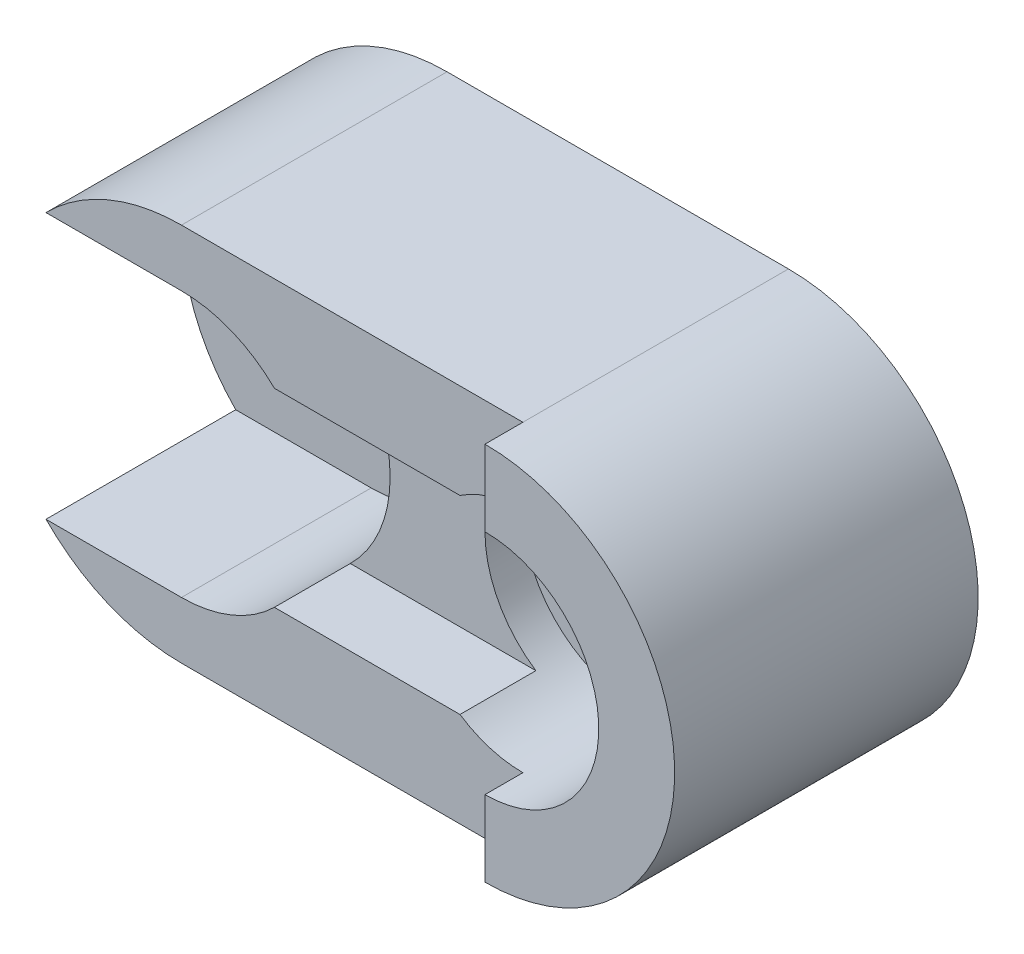
ISO-10303-21;
HEADER;
FILE_DESCRIPTION(('STEP AP214'),'2;1');
FILE_NAME('part.step','',(''),(''),'','','');
FILE_SCHEMA(('AUTOMOTIVE_DESIGN { 1 0 10303 214 1 1 1 1 }'));
ENDSEC;
DATA;
#1=APPLICATION_CONTEXT('core data for automotive mechanical design processes');
#2=APPLICATION_PROTOCOL_DEFINITION('international standard','automotive_design',2000,#1);
#3=PRODUCT_CONTEXT('',#1,'mechanical');
#4=PRODUCT('Part','Part','',(#3));
#5=PRODUCT_RELATED_PRODUCT_CATEGORY('part','',(#4));
#6=PRODUCT_DEFINITION_FORMATION('','',#4);
#7=PRODUCT_DEFINITION_CONTEXT('part definition',#1,'design');
#8=PRODUCT_DEFINITION('design','',#6,#7);
#9=PRODUCT_DEFINITION_SHAPE('','',#8);
#10=(LENGTH_UNIT() NAMED_UNIT(*) SI_UNIT(.MILLI.,.METRE.));
#11=(NAMED_UNIT(*) PLANE_ANGLE_UNIT() SI_UNIT($,.RADIAN.));
#12=(NAMED_UNIT(*) SI_UNIT($,.STERADIAN.) SOLID_ANGLE_UNIT());
#13=UNCERTAINTY_MEASURE_WITH_UNIT(LENGTH_MEASURE(1.E-05),#10,'distance_accuracy_value','');
#14=(GEOMETRIC_REPRESENTATION_CONTEXT(3) GLOBAL_UNCERTAINTY_ASSIGNED_CONTEXT((#13)) GLOBAL_UNIT_ASSIGNED_CONTEXT((#10,
#11,#12)) REPRESENTATION_CONTEXT('',''));
#15=CARTESIAN_POINT('',(0.,0.,0.));
#16=DIRECTION('',(0.,0.,1.));
#17=DIRECTION('',(1.,0.,0.));
#18=AXIS2_PLACEMENT_3D('',#15,#16,#17);
#19=CARTESIAN_POINT('',(0.,0.,70.));
#20=DIRECTION('',(0.,0.,1.));
#21=DIRECTION('',(1.,0.,0.));
#22=AXIS2_PLACEMENT_3D('',#19,#20,#21);
#23=PLANE('',#22);
#24=CARTESIAN_POINT('',(90.,0.,70.));
#25=DIRECTION('',(0.,0.,1.));
#26=DIRECTION('',(1.,0.,0.));
#27=AXIS2_PLACEMENT_3D('',#24,#25,#26);
#28=CIRCLE('',#27,30.);
#29=CARTESIAN_POINT('',(73.416876048223,-25.,70.));
#30=VERTEX_POINT('',#29);
#31=CARTESIAN_POINT('',(90.,-30.,70.));
#32=VERTEX_POINT('',#31);
#33=EDGE_CURVE('E215',#30,#32,#28,.T.);
#34=ORIENTED_EDGE('',*,*,#33,.F.);
#35=DIRECTION('',(-1.,0.,0.));
#36=VECTOR('',#35,1.);
#37=CARTESIAN_POINT('',(0.,-25.,70.));
#38=LINE('',#37,#36);
#39=CARTESIAN_POINT('',(24.4948974278318,-25.,70.));
#40=VERTEX_POINT('',#39);
#41=EDGE_CURVE('E146',#30,#40,#38,.T.);
#42=ORIENTED_EDGE('',*,*,#41,.T.);
#43=CARTESIAN_POINT('',(0.,0.,70.));
#44=DIRECTION('',(0.,0.,1.));
#45=DIRECTION('',(-1.,0.,0.));
#46=AXIS2_PLACEMENT_3D('',#43,#44,#45);
#47=CIRCLE('',#46,35.);
#48=CARTESIAN_POINT('',(0.,-35.,70.));
#49=VERTEX_POINT('',#48);
#50=EDGE_CURVE('E196',#49,#40,#47,.T.);
#51=ORIENTED_EDGE('',*,*,#50,.F.);
#52=DIRECTION('',(1.,0.,0.));
#53=VECTOR('',#52,1.);
#54=CARTESIAN_POINT('',(0.,-35.,70.));
#55=LINE('',#54,#53);
#56=CARTESIAN_POINT('',(-35.7071421427143,-35.,70.));
#57=VERTEX_POINT('',#56);
#58=EDGE_CURVE('E180',#57,#49,#55,.T.);
#59=ORIENTED_EDGE('',*,*,#58,.F.);
#60=CARTESIAN_POINT('',(0.,0.,70.));
#61=DIRECTION('',(0.,0.,1.));
#62=DIRECTION('',(1.,0.,0.));
#63=AXIS2_PLACEMENT_3D('',#60,#61,#62);
#64=CIRCLE('',#63,50.);
#65=CARTESIAN_POINT('',(0.,-50.,70.));
#66=VERTEX_POINT('',#65);
#67=EDGE_CURVE('E253',#57,#66,#64,.T.);
#68=ORIENTED_EDGE('',*,*,#67,.T.);
#69=DIRECTION('',(1.,0.,0.));
#70=VECTOR('',#69,1.);
#71=CARTESIAN_POINT('',(0.,-50.,70.));
#72=LINE('',#71,#70);
#73=CARTESIAN_POINT('',(90.,-50.,70.));
#74=VERTEX_POINT('',#73);
#75=EDGE_CURVE('E252',#66,#74,#72,.T.);
#76=ORIENTED_EDGE('',*,*,#75,.T.);
#77=DIRECTION('',(0.,-1.,0.));
#78=VECTOR('',#77,1.);
#79=CARTESIAN_POINT('',(90.,-30.,70.));
#80=LINE('',#79,#78);
#81=EDGE_CURVE('E226',#32,#74,#80,.T.);
#82=ORIENTED_EDGE('',*,*,#81,.F.);
#83=EDGE_LOOP('',(#34,#42,#51,#59,#68,#76,#82));
#84=FACE_BOUND('',#83,.T.);
#85=ADVANCED_FACE('F33',(#84),#23,.T.);
#86=CARTESIAN_POINT('',(90.,0.,80.));
#87=DIRECTION('',(0.,0.,-1.));
#88=DIRECTION('',(-1.,0.,0.));
#89=AXIS2_PLACEMENT_3D('',#86,#87,#88);
#90=CYLINDRICAL_SURFACE('',#89,30.);
#91=CARTESIAN_POINT('',(90.,0.,40.));
#92=DIRECTION('',(0.,0.,1.));
#93=DIRECTION('',(1.,0.,0.));
#94=AXIS2_PLACEMENT_3D('',#91,#92,#93);
#95=CIRCLE('',#94,30.);
#96=CARTESIAN_POINT('',(120.,0.,40.));
#97=VERTEX_POINT('',#96);
#98=EDGE_CURVE('E216',#97,#97,#95,.T.);
#99=ORIENTED_EDGE('',*,*,#98,.F.);
#100=EDGE_LOOP('',(#99));
#101=FACE_BOUND('',#100,.T.);
#102=DIRECTION('',(0.,0.,1.));
#103=VECTOR('',#102,1.);
#104=CARTESIAN_POINT('',(73.416876048223,-25.,50.));
#105=LINE('',#104,#103);
#106=CARTESIAN_POINT('',(73.416876048223,-25.,50.));
#107=VERTEX_POINT('',#106);
#108=EDGE_CURVE('E141',#107,#30,#105,.T.);
#109=ORIENTED_EDGE('',*,*,#108,.T.);
#110=ORIENTED_EDGE('',*,*,#33,.T.);
#111=DIRECTION('',(0.,0.,-1.));
#112=VECTOR('',#111,1.);
#113=CARTESIAN_POINT('',(90.,-30.,80.));
#114=LINE('',#113,#112);
#115=CARTESIAN_POINT('',(90.,-30.,80.));
#116=VERTEX_POINT('',#115);
#117=EDGE_CURVE('E239',#116,#32,#114,.T.);
#118=ORIENTED_EDGE('',*,*,#117,.F.);
#119=CARTESIAN_POINT('',(90.,0.,80.));
#120=DIRECTION('',(0.,0.,-1.));
#121=DIRECTION('',(-1.,0.,0.));
#122=AXIS2_PLACEMENT_3D('',#119,#120,#121);
#123=CIRCLE('',#122,30.);
#124=CARTESIAN_POINT('',(90.,30.,80.));
#125=VERTEX_POINT('',#124);
#126=EDGE_CURVE('E228',#125,#116,#123,.T.);
#127=ORIENTED_EDGE('',*,*,#126,.F.);
#128=DIRECTION('',(0.,0.,-1.));
#129=VECTOR('',#128,1.);
#130=CARTESIAN_POINT('',(90.,30.,80.));
#131=LINE('',#130,#129);
#132=CARTESIAN_POINT('',(90.,30.,70.));
#133=VERTEX_POINT('',#132);
#134=EDGE_CURVE('E242',#125,#133,#131,.T.);
#135=ORIENTED_EDGE('',*,*,#134,.T.);
#136=CARTESIAN_POINT('',(73.416876048223,25.,70.));
#137=VERTEX_POINT('',#136);
#138=EDGE_CURVE('E220',#133,#137,#28,.T.);
#139=ORIENTED_EDGE('',*,*,#138,.T.);
#140=DIRECTION('',(0.,0.,1.));
#141=VECTOR('',#140,1.);
#142=CARTESIAN_POINT('',(73.416876048223,25.,50.));
#143=LINE('',#142,#141);
#144=CARTESIAN_POINT('',(73.416876048223,25.,50.));
#145=VERTEX_POINT('',#144);
#146=EDGE_CURVE('E150',#145,#137,#143,.T.);
#147=ORIENTED_EDGE('',*,*,#146,.F.);
#148=CARTESIAN_POINT('',(90.,0.,50.));
#149=DIRECTION('',(0.,0.,1.));
#150=DIRECTION('',(1.,0.,0.));
#151=AXIS2_PLACEMENT_3D('',#148,#149,#150);
#152=CIRCLE('',#151,30.);
#153=EDGE_CURVE('E154',#107,#145,#152,.F.);
#154=ORIENTED_EDGE('',*,*,#153,.F.);
#155=EDGE_LOOP('',(#109,#110,#118,#127,#135,#139,#147,#154));
#156=FACE_BOUND('',#155,.T.);
#157=ADVANCED_FACE('F160',(#101,#156),#90,.F.);
#158=CARTESIAN_POINT('',(0.,0.,20.));
#159=DIRECTION('',(0.,0.,1.));
#160=DIRECTION('',(1.,0.,0.));
#161=AXIS2_PLACEMENT_3D('',#158,#159,#160);
#162=CYLINDRICAL_SURFACE('',#161,35.);
#163=DIRECTION('',(0.,0.,1.));
#164=VECTOR('',#163,1.);
#165=CARTESIAN_POINT('',(24.4948974278318,-25.,50.));
#166=LINE('',#165,#164);
#167=CARTESIAN_POINT('',(24.4948974278318,-25.,50.));
#168=VERTEX_POINT('',#167);
#169=EDGE_CURVE('E168',#168,#40,#166,.T.);
#170=ORIENTED_EDGE('',*,*,#169,.F.);
#171=CARTESIAN_POINT('',(0.,0.,50.));
#172=DIRECTION('',(0.,0.,1.));
#173=DIRECTION('',(1.,0.,0.));
#174=AXIS2_PLACEMENT_3D('',#171,#172,#173);
#175=CIRCLE('',#174,35.);
#176=CARTESIAN_POINT('',(24.4948974278318,25.,50.));
#177=VERTEX_POINT('',#176);
#178=EDGE_CURVE('E151',#177,#168,#175,.F.);
#179=ORIENTED_EDGE('',*,*,#178,.F.);
#180=DIRECTION('',(0.,0.,1.));
#181=VECTOR('',#180,1.);
#182=CARTESIAN_POINT('',(24.4948974278318,25.,50.));
#183=LINE('',#182,#181);
#184=CARTESIAN_POINT('',(24.4948974278318,25.,70.));
#185=VERTEX_POINT('',#184);
#186=EDGE_CURVE('E171',#177,#185,#183,.T.);
#187=ORIENTED_EDGE('',*,*,#186,.T.);
#188=CARTESIAN_POINT('',(0.,35.,70.));
#189=VERTEX_POINT('',#188);
#190=EDGE_CURVE('E195',#185,#189,#47,.T.);
#191=ORIENTED_EDGE('',*,*,#190,.T.);
#192=DIRECTION('',(0.,0.,1.));
#193=VECTOR('',#192,1.);
#194=CARTESIAN_POINT('',(0.,35.,20.));
#195=LINE('',#194,#193);
#196=CARTESIAN_POINT('',(0.,35.,20.));
#197=VERTEX_POINT('',#196);
#198=EDGE_CURVE('E204',#197,#189,#195,.T.);
#199=ORIENTED_EDGE('',*,*,#198,.F.);
#200=CARTESIAN_POINT('',(0.,0.,20.));
#201=DIRECTION('',(0.,0.,1.));
#202=DIRECTION('',(-1.,0.,0.));
#203=AXIS2_PLACEMENT_3D('',#200,#201,#202);
#204=CIRCLE('',#203,35.);
#205=CARTESIAN_POINT('',(0.,-35.,20.));
#206=VERTEX_POINT('',#205);
#207=EDGE_CURVE('E188',#206,#197,#204,.T.);
#208=ORIENTED_EDGE('',*,*,#207,.F.);
#209=DIRECTION('',(0.,0.,1.));
#210=VECTOR('',#209,1.);
#211=CARTESIAN_POINT('',(0.,-35.,20.));
#212=LINE('',#211,#210);
#213=EDGE_CURVE('E207',#206,#49,#212,.T.);
#214=ORIENTED_EDGE('',*,*,#213,.T.);
#215=ORIENTED_EDGE('',*,*,#50,.T.);
#216=EDGE_LOOP('',(#170,#179,#187,#191,#199,#208,#214,#215));
#217=FACE_BOUND('',#216,.T.);
#218=ADVANCED_FACE('F319',(#217),#162,.F.);
#219=CARTESIAN_POINT('',(0.,0.,70.));
#220=DIRECTION('',(0.,0.,-1.));
#221=DIRECTION('',(-1.,0.,0.));
#222=AXIS2_PLACEMENT_3D('',#219,#220,#221);
#223=CYLINDRICAL_SURFACE('',#222,50.);
#224=CARTESIAN_POINT('',(0.,0.,20.));
#225=DIRECTION('',(0.,0.,1.));
#226=DIRECTION('',(1.,0.,0.));
#227=AXIS2_PLACEMENT_3D('',#224,#225,#226);
#228=CIRCLE('',#227,50.);
#229=CARTESIAN_POINT('',(-35.7071421427143,35.,20.));
#230=VERTEX_POINT('',#229);
#231=CARTESIAN_POINT('',(-35.7071421427143,-35.,20.));
#232=VERTEX_POINT('',#231);
#233=EDGE_CURVE('E181',#230,#232,#228,.T.);
#234=ORIENTED_EDGE('',*,*,#233,.F.);
#235=DIRECTION('',(0.,0.,1.));
#236=VECTOR('',#235,1.);
#237=CARTESIAN_POINT('',(-35.7071421427143,35.,20.));
#238=LINE('',#237,#236);
#239=CARTESIAN_POINT('',(-35.7071421427143,35.,70.));
#240=VERTEX_POINT('',#239);
#241=EDGE_CURVE('E200',#230,#240,#238,.T.);
#242=ORIENTED_EDGE('',*,*,#241,.T.);
#243=CARTESIAN_POINT('',(0.,50.,70.));
#244=VERTEX_POINT('',#243);
#245=EDGE_CURVE('E249',#244,#240,#64,.T.);
#246=ORIENTED_EDGE('',*,*,#245,.F.);
#247=DIRECTION('',(0.,0.,-1.));
#248=VECTOR('',#247,1.);
#249=CARTESIAN_POINT('',(0.,50.,70.));
#250=LINE('',#249,#248);
#251=CARTESIAN_POINT('',(0.,50.,0.));
#252=VERTEX_POINT('',#251);
#253=EDGE_CURVE('E257',#244,#252,#250,.T.);
#254=ORIENTED_EDGE('',*,*,#253,.T.);
#255=CARTESIAN_POINT('',(0.,0.,0.));
#256=DIRECTION('',(0.,0.,1.));
#257=DIRECTION('',(1.,0.,0.));
#258=AXIS2_PLACEMENT_3D('',#255,#256,#257);
#259=CIRCLE('',#258,50.);
#260=CARTESIAN_POINT('',(0.,-50.,0.));
#261=VERTEX_POINT('',#260);
#262=EDGE_CURVE('E248',#252,#261,#259,.T.);
#263=ORIENTED_EDGE('',*,*,#262,.T.);
#264=DIRECTION('',(0.,0.,-1.));
#265=VECTOR('',#264,1.);
#266=CARTESIAN_POINT('',(0.,-50.,70.));
#267=LINE('',#266,#265);
#268=EDGE_CURVE('E11',#66,#261,#267,.T.);
#269=ORIENTED_EDGE('',*,*,#268,.F.);
#270=ORIENTED_EDGE('',*,*,#67,.F.);
#271=DIRECTION('',(0.,0.,1.));
#272=VECTOR('',#271,1.);
#273=CARTESIAN_POINT('',(-35.7071421427143,-35.,20.));
#274=LINE('',#273,#272);
#275=EDGE_CURVE('E56',#232,#57,#274,.T.);
#276=ORIENTED_EDGE('',*,*,#275,.F.);
#277=EDGE_LOOP('',(#234,#242,#246,#254,#263,#269,#270,#276));
#278=FACE_BOUND('',#277,.T.);
#279=ADVANCED_FACE('F35',(#278),#223,.T.);
#280=CARTESIAN_POINT('',(0.,-50.,70.));
#281=DIRECTION('',(0.,1.,0.));
#282=DIRECTION('',(0.,0.,1.));
#283=AXIS2_PLACEMENT_3D('',#280,#281,#282);
#284=PLANE('',#283);
#285=DIRECTION('',(1.,0.,0.));
#286=VECTOR('',#285,1.);
#287=CARTESIAN_POINT('',(0.,-50.,0.));
#288=LINE('',#287,#286);
#289=CARTESIAN_POINT('',(90.,-50.,0.));
#290=VERTEX_POINT('',#289);
#291=EDGE_CURVE('E260',#261,#290,#288,.T.);
#292=ORIENTED_EDGE('',*,*,#291,.T.);
#293=DIRECTION('',(0.,0.,-1.));
#294=VECTOR('',#293,1.);
#295=CARTESIAN_POINT('',(90.,-50.,70.));
#296=LINE('',#295,#294);
#297=EDGE_CURVE('E41',#74,#290,#296,.T.);
#298=ORIENTED_EDGE('',*,*,#297,.F.);
#299=ORIENTED_EDGE('',*,*,#75,.F.);
#300=ORIENTED_EDGE('',*,*,#268,.T.);
#301=EDGE_LOOP('',(#292,#298,#299,#300));
#302=FACE_BOUND('',#301,.T.);
#303=ADVANCED_FACE('F311',(#302),#284,.F.);
#304=CARTESIAN_POINT('',(90.,0.,70.));
#305=DIRECTION('',(0.,0.,-1.));
#306=DIRECTION('',(-1.,0.,0.));
#307=AXIS2_PLACEMENT_3D('',#304,#305,#306);
#308=CYLINDRICAL_SURFACE('',#307,50.);
#309=CARTESIAN_POINT('',(90.,0.,0.));
#310=DIRECTION('',(0.,0.,1.));
#311=DIRECTION('',(-1.,0.,0.));
#312=AXIS2_PLACEMENT_3D('',#309,#310,#311);
#313=CIRCLE('',#312,50.);
#314=CARTESIAN_POINT('',(90.,50.,0.));
#315=VERTEX_POINT('',#314);
#316=EDGE_CURVE('E262',#290,#315,#313,.T.);
#317=ORIENTED_EDGE('',*,*,#316,.T.);
#318=DIRECTION('',(0.,0.,-1.));
#319=VECTOR('',#318,1.);
#320=CARTESIAN_POINT('',(90.,50.,70.));
#321=LINE('',#320,#319);
#322=CARTESIAN_POINT('',(90.,50.,70.));
#323=VERTEX_POINT('',#322);
#324=EDGE_CURVE('E268',#323,#315,#321,.T.);
#325=ORIENTED_EDGE('',*,*,#324,.F.);
#326=DIRECTION('',(0.,0.,-1.));
#327=VECTOR('',#326,1.);
#328=CARTESIAN_POINT('',(90.,50.,80.));
#329=LINE('',#328,#327);
#330=CARTESIAN_POINT('',(90.,50.,80.));
#331=VERTEX_POINT('',#330);
#332=EDGE_CURVE('E245',#331,#323,#329,.T.);
#333=ORIENTED_EDGE('',*,*,#332,.F.);
#334=CARTESIAN_POINT('',(90.,0.,80.));
#335=DIRECTION('',(0.,0.,1.));
#336=DIRECTION('',(-1.,0.,0.));
#337=AXIS2_PLACEMENT_3D('',#334,#335,#336);
#338=CIRCLE('',#337,50.);
#339=CARTESIAN_POINT('',(90.,-50.,80.));
#340=VERTEX_POINT('',#339);
#341=EDGE_CURVE('E222',#340,#331,#338,.T.);
#342=ORIENTED_EDGE('',*,*,#341,.F.);
#343=DIRECTION('',(0.,0.,-1.));
#344=VECTOR('',#343,1.);
#345=CARTESIAN_POINT('',(90.,-50.,80.));
#346=LINE('',#345,#344);
#347=EDGE_CURVE('E232',#340,#74,#346,.T.);
#348=ORIENTED_EDGE('',*,*,#347,.T.);
#349=ORIENTED_EDGE('',*,*,#297,.T.);
#350=EDGE_LOOP('',(#317,#325,#333,#342,#348,#349));
#351=FACE_BOUND('',#350,.T.);
#352=ADVANCED_FACE('F274',(#351),#308,.T.);
#353=CARTESIAN_POINT('',(0.,50.,70.));
#354=DIRECTION('',(0.,-1.,0.));
#355=DIRECTION('',(0.,0.,-1.));
#356=AXIS2_PLACEMENT_3D('',#353,#354,#355);
#357=PLANE('',#356);
#358=DIRECTION('',(-1.,0.,0.));
#359=VECTOR('',#358,1.);
#360=CARTESIAN_POINT('',(0.,50.,0.));
#361=LINE('',#360,#359);
#362=EDGE_CURVE('E264',#315,#252,#361,.T.);
#363=ORIENTED_EDGE('',*,*,#362,.T.);
#364=ORIENTED_EDGE('',*,*,#253,.F.);
#365=DIRECTION('',(-1.,0.,0.));
#366=VECTOR('',#365,1.);
#367=CARTESIAN_POINT('',(0.,50.,70.));
#368=LINE('',#367,#366);
#369=EDGE_CURVE('E255',#323,#244,#368,.T.);
#370=ORIENTED_EDGE('',*,*,#369,.F.);
#371=ORIENTED_EDGE('',*,*,#324,.T.);
#372=EDGE_LOOP('',(#363,#364,#370,#371));
#373=FACE_BOUND('',#372,.T.);
#374=ADVANCED_FACE('F286',(#373),#357,.F.);
#375=DIRECTION('',(-1.,0.,0.));
#376=VECTOR('',#375,1.);
#377=CARTESIAN_POINT('',(0.,25.,70.));
#378=LINE('',#377,#376);
#379=EDGE_CURVE('E158',#137,#185,#378,.T.);
#380=ORIENTED_EDGE('',*,*,#379,.F.);
#381=ORIENTED_EDGE('',*,*,#138,.F.);
#382=DIRECTION('',(0.,-1.,0.));
#383=VECTOR('',#382,1.);
#384=CARTESIAN_POINT('',(90.,50.,70.));
#385=LINE('',#384,#383);
#386=EDGE_CURVE('E219',#323,#133,#385,.T.);
#387=ORIENTED_EDGE('',*,*,#386,.F.);
#388=ORIENTED_EDGE('',*,*,#369,.T.);
#389=ORIENTED_EDGE('',*,*,#245,.T.);
#390=DIRECTION('',(-1.,0.,0.));
#391=VECTOR('',#390,1.);
#392=CARTESIAN_POINT('',(0.,35.,70.));
#393=LINE('',#392,#391);
#394=EDGE_CURVE('E185',#189,#240,#393,.T.);
#395=ORIENTED_EDGE('',*,*,#394,.F.);
#396=ORIENTED_EDGE('',*,*,#190,.F.);
#397=EDGE_LOOP('',(#380,#381,#387,#388,#389,#395,#396));
#398=FACE_BOUND('',#397,.T.);
#399=ADVANCED_FACE('F295',(#398),#23,.T.);
#400=CARTESIAN_POINT('',(0.,0.,0.));
#401=DIRECTION('',(0.,0.,1.));
#402=DIRECTION('',(1.,0.,0.));
#403=AXIS2_PLACEMENT_3D('',#400,#401,#402);
#404=PLANE('',#403);
#405=CARTESIAN_POINT('',(0.,0.,0.));
#406=DIRECTION('',(0.,0.,1.));
#407=DIRECTION('',(1.,0.,0.));
#408=AXIS2_PLACEMENT_3D('',#405,#406,#407);
#409=CIRCLE('',#408,20.);
#410=CARTESIAN_POINT('',(20.,0.,0.));
#411=VERTEX_POINT('',#410);
#412=EDGE_CURVE('E177',#411,#411,#409,.T.);
#413=ORIENTED_EDGE('',*,*,#412,.T.);
#414=EDGE_LOOP('',(#413));
#415=FACE_BOUND('',#414,.T.);
#416=CARTESIAN_POINT('',(90.,0.,0.));
#417=DIRECTION('',(0.,0.,1.));
#418=DIRECTION('',(1.,0.,0.));
#419=AXIS2_PLACEMENT_3D('',#416,#417,#418);
#420=CIRCLE('',#419,9.99999999999999);
#421=CARTESIAN_POINT('',(100.,0.,0.));
#422=VERTEX_POINT('',#421);
#423=EDGE_CURVE('E212',#422,#422,#420,.T.);
#424=ORIENTED_EDGE('',*,*,#423,.T.);
#425=EDGE_LOOP('',(#424));
#426=FACE_BOUND('',#425,.T.);
#427=ORIENTED_EDGE('',*,*,#262,.F.);
#428=ORIENTED_EDGE('',*,*,#362,.F.);
#429=ORIENTED_EDGE('',*,*,#316,.F.);
#430=ORIENTED_EDGE('',*,*,#291,.F.);
#431=EDGE_LOOP('',(#427,#428,#429,#430));
#432=FACE_BOUND('',#431,.T.);
#433=ADVANCED_FACE('F283',(#415,#426,#432),#404,.F.);
#434=CARTESIAN_POINT('',(90.,50.,80.));
#435=DIRECTION('',(1.,0.,0.));
#436=DIRECTION('',(0.,0.,-1.));
#437=AXIS2_PLACEMENT_3D('',#434,#435,#436);
#438=PLANE('',#437);
#439=ORIENTED_EDGE('',*,*,#386,.T.);
#440=ORIENTED_EDGE('',*,*,#134,.F.);
#441=DIRECTION('',(0.,-1.,0.));
#442=VECTOR('',#441,1.);
#443=CARTESIAN_POINT('',(90.,50.,80.));
#444=LINE('',#443,#442);
#445=EDGE_CURVE('E225',#331,#125,#444,.T.);
#446=ORIENTED_EDGE('',*,*,#445,.F.);
#447=ORIENTED_EDGE('',*,*,#332,.T.);
#448=EDGE_LOOP('',(#439,#440,#446,#447));
#449=FACE_BOUND('',#448,.T.);
#450=ADVANCED_FACE('F299',(#449),#438,.F.);
#451=CARTESIAN_POINT('',(90.,-30.,80.));
#452=DIRECTION('',(1.,0.,0.));
#453=DIRECTION('',(0.,0.,-1.));
#454=AXIS2_PLACEMENT_3D('',#451,#452,#453);
#455=PLANE('',#454);
#456=ORIENTED_EDGE('',*,*,#81,.T.);
#457=ORIENTED_EDGE('',*,*,#347,.F.);
#458=DIRECTION('',(0.,-1.,0.));
#459=VECTOR('',#458,1.);
#460=CARTESIAN_POINT('',(90.,-30.,80.));
#461=LINE('',#460,#459);
#462=EDGE_CURVE('E230',#116,#340,#461,.T.);
#463=ORIENTED_EDGE('',*,*,#462,.F.);
#464=ORIENTED_EDGE('',*,*,#117,.T.);
#465=EDGE_LOOP('',(#456,#457,#463,#464));
#466=FACE_BOUND('',#465,.T.);
#467=ADVANCED_FACE('F307',(#466),#455,.F.);
#468=CARTESIAN_POINT('',(90.,0.,80.));
#469=DIRECTION('',(0.,0.,-1.));
#470=DIRECTION('',(-1.,0.,0.));
#471=AXIS2_PLACEMENT_3D('',#468,#469,#470);
#472=PLANE('',#471);
#473=ORIENTED_EDGE('',*,*,#341,.T.);
#474=ORIENTED_EDGE('',*,*,#445,.T.);
#475=ORIENTED_EDGE('',*,*,#126,.T.);
#476=ORIENTED_EDGE('',*,*,#462,.T.);
#477=EDGE_LOOP('',(#473,#474,#475,#476));
#478=FACE_BOUND('',#477,.T.);
#479=ADVANCED_FACE('F302',(#478),#472,.F.);
#480=CARTESIAN_POINT('',(90.,0.,40.));
#481=DIRECTION('',(0.,0.,1.));
#482=DIRECTION('',(1.,0.,0.));
#483=AXIS2_PLACEMENT_3D('',#480,#481,#482);
#484=PLANE('',#483);
#485=CARTESIAN_POINT('',(90.,0.,40.));
#486=DIRECTION('',(0.,0.,1.));
#487=DIRECTION('',(1.,0.,0.));
#488=AXIS2_PLACEMENT_3D('',#485,#486,#487);
#489=CIRCLE('',#488,9.99999999999999);
#490=CARTESIAN_POINT('',(100.,0.,40.));
#491=VERTEX_POINT('',#490);
#492=EDGE_CURVE('E203',#491,#491,#489,.T.);
#493=ORIENTED_EDGE('',*,*,#492,.F.);
#494=EDGE_LOOP('',(#493));
#495=FACE_BOUND('',#494,.T.);
#496=ORIENTED_EDGE('',*,*,#98,.T.);
#497=EDGE_LOOP('',(#496));
#498=FACE_BOUND('',#497,.T.);
#499=ADVANCED_FACE('F426',(#495,#498),#484,.T.);
#500=CARTESIAN_POINT('',(90.,0.,-31.));
#501=DIRECTION('',(0.,0.,1.));
#502=DIRECTION('',(1.,0.,0.));
#503=AXIS2_PLACEMENT_3D('',#500,#501,#502);
#504=CYLINDRICAL_SURFACE('',#503,9.99999999999999);
#505=ORIENTED_EDGE('',*,*,#492,.T.);
#506=EDGE_LOOP('',(#505));
#507=FACE_BOUND('',#506,.T.);
#508=ORIENTED_EDGE('',*,*,#423,.F.);
#509=EDGE_LOOP('',(#508));
#510=FACE_BOUND('',#509,.T.);
#511=ADVANCED_FACE('F333',(#507,#510),#504,.F.);
#512=CARTESIAN_POINT('',(0.,35.,20.));
#513=DIRECTION('',(0.,1.,0.));
#514=DIRECTION('',(0.,0.,1.));
#515=AXIS2_PLACEMENT_3D('',#512,#513,#514);
#516=PLANE('',#515);
#517=ORIENTED_EDGE('',*,*,#394,.T.);
#518=ORIENTED_EDGE('',*,*,#241,.F.);
#519=DIRECTION('',(-1.,0.,0.));
#520=VECTOR('',#519,1.);
#521=CARTESIAN_POINT('',(0.,35.,20.));
#522=LINE('',#521,#520);
#523=EDGE_CURVE('E191',#197,#230,#522,.T.);
#524=ORIENTED_EDGE('',*,*,#523,.F.);
#525=ORIENTED_EDGE('',*,*,#198,.T.);
#526=EDGE_LOOP('',(#517,#518,#524,#525));
#527=FACE_BOUND('',#526,.T.);
#528=ADVANCED_FACE('F317',(#527),#516,.F.);
#529=CARTESIAN_POINT('',(0.,-35.,20.));
#530=DIRECTION('',(0.,-1.,0.));
#531=DIRECTION('',(0.,0.,-1.));
#532=AXIS2_PLACEMENT_3D('',#529,#530,#531);
#533=PLANE('',#532);
#534=ORIENTED_EDGE('',*,*,#58,.T.);
#535=ORIENTED_EDGE('',*,*,#213,.F.);
#536=DIRECTION('',(1.,0.,0.));
#537=VECTOR('',#536,1.);
#538=CARTESIAN_POINT('',(0.,-35.,20.));
#539=LINE('',#538,#537);
#540=EDGE_CURVE('E184',#232,#206,#539,.T.);
#541=ORIENTED_EDGE('',*,*,#540,.F.);
#542=ORIENTED_EDGE('',*,*,#275,.T.);
#543=EDGE_LOOP('',(#534,#535,#541,#542));
#544=FACE_BOUND('',#543,.T.);
#545=ADVANCED_FACE('F323',(#544),#533,.F.);
#546=CARTESIAN_POINT('',(0.,0.,20.));
#547=DIRECTION('',(0.,0.,1.));
#548=DIRECTION('',(1.,0.,0.));
#549=AXIS2_PLACEMENT_3D('',#546,#547,#548);
#550=PLANE('',#549);
#551=CARTESIAN_POINT('',(0.,0.,20.));
#552=DIRECTION('',(0.,0.,1.));
#553=DIRECTION('',(1.,0.,0.));
#554=AXIS2_PLACEMENT_3D('',#551,#552,#553);
#555=CIRCLE('',#554,20.);
#556=CARTESIAN_POINT('',(20.,0.,20.));
#557=VERTEX_POINT('',#556);
#558=EDGE_CURVE('E170',#557,#557,#555,.T.);
#559=ORIENTED_EDGE('',*,*,#558,.F.);
#560=EDGE_LOOP('',(#559));
#561=FACE_BOUND('',#560,.T.);
#562=ORIENTED_EDGE('',*,*,#233,.T.);
#563=ORIENTED_EDGE('',*,*,#540,.T.);
#564=ORIENTED_EDGE('',*,*,#207,.T.);
#565=ORIENTED_EDGE('',*,*,#523,.T.);
#566=EDGE_LOOP('',(#562,#563,#564,#565));
#567=FACE_BOUND('',#566,.T.);
#568=ADVANCED_FACE('F313',(#561,#567),#550,.T.);
#569=CARTESIAN_POINT('',(0.,0.,-30.));
#570=DIRECTION('',(0.,0.,1.));
#571=DIRECTION('',(1.,0.,0.));
#572=AXIS2_PLACEMENT_3D('',#569,#570,#571);
#573=CYLINDRICAL_SURFACE('',#572,20.);
#574=ORIENTED_EDGE('',*,*,#558,.T.);
#575=EDGE_LOOP('',(#574));
#576=FACE_BOUND('',#575,.T.);
#577=ORIENTED_EDGE('',*,*,#412,.F.);
#578=EDGE_LOOP('',(#577));
#579=FACE_BOUND('',#578,.T.);
#580=ADVANCED_FACE('F330',(#576,#579),#573,.F.);
#581=CARTESIAN_POINT('',(0.,-25.,50.));
#582=DIRECTION('',(0.,1.,0.));
#583=DIRECTION('',(0.,0.,1.));
#584=AXIS2_PLACEMENT_3D('',#581,#582,#583);
#585=PLANE('',#584);
#586=ORIENTED_EDGE('',*,*,#41,.F.);
#587=ORIENTED_EDGE('',*,*,#108,.F.);
#588=DIRECTION('',(-1.,0.,0.));
#589=VECTOR('',#588,1.);
#590=CARTESIAN_POINT('',(0.,-25.,50.));
#591=LINE('',#590,#589);
#592=EDGE_CURVE('E144',#107,#168,#591,.T.);
#593=ORIENTED_EDGE('',*,*,#592,.T.);
#594=ORIENTED_EDGE('',*,*,#169,.T.);
#595=EDGE_LOOP('',(#586,#587,#593,#594));
#596=FACE_BOUND('',#595,.T.);
#597=ADVANCED_FACE('F143',(#596),#585,.T.);
#598=CARTESIAN_POINT('',(0.,25.,50.));
#599=DIRECTION('',(0.,1.,0.));
#600=DIRECTION('',(-1.,0.,0.));
#601=AXIS2_PLACEMENT_3D('',#598,#599,#600);
#602=PLANE('',#601);
#603=ORIENTED_EDGE('',*,*,#379,.T.);
#604=ORIENTED_EDGE('',*,*,#186,.F.);
#605=DIRECTION('',(-1.,0.,0.));
#606=VECTOR('',#605,1.);
#607=CARTESIAN_POINT('',(0.,25.,50.));
#608=LINE('',#607,#606);
#609=EDGE_CURVE('E48',#145,#177,#608,.T.);
#610=ORIENTED_EDGE('',*,*,#609,.F.);
#611=ORIENTED_EDGE('',*,*,#146,.T.);
#612=EDGE_LOOP('',(#603,#604,#610,#611));
#613=FACE_BOUND('',#612,.T.);
#614=ADVANCED_FACE('F321',(#613),#602,.F.);
#615=CARTESIAN_POINT('',(0.,0.,50.));
#616=DIRECTION('',(0.,0.,1.));
#617=DIRECTION('',(1.,0.,0.));
#618=AXIS2_PLACEMENT_3D('',#615,#616,#617);
#619=PLANE('',#618);
#620=ORIENTED_EDGE('',*,*,#592,.F.);
#621=ORIENTED_EDGE('',*,*,#153,.T.);
#622=ORIENTED_EDGE('',*,*,#609,.T.);
#623=ORIENTED_EDGE('',*,*,#178,.T.);
#624=EDGE_LOOP('',(#620,#621,#622,#623));
#625=FACE_BOUND('',#624,.T.);
#626=ADVANCED_FACE('F153',(#625),#619,.T.);
#627=CLOSED_SHELL('',(#85,#157,#218,#279,#303,#352,#374,#399,#433,#450,#467,#479,#499,#511,#528,
#545,#568,#580,#597,#614,#626));
#628=MANIFOLD_SOLID_BREP('B2',#627);
#629=ADVANCED_BREP_SHAPE_REPRESENTATION('',(#18,#628),#14);
#630=SHAPE_DEFINITION_REPRESENTATION(#9,#629);
ENDSEC;
END-ISO-10303-21;
